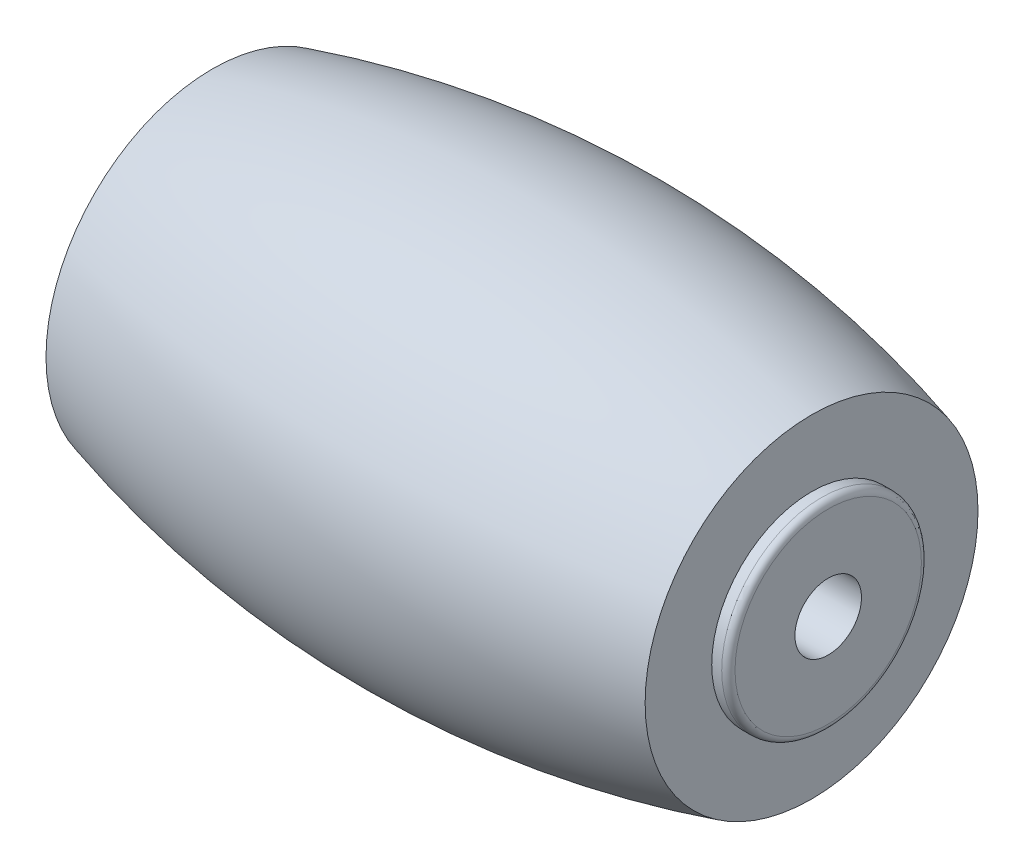
ISO-10303-21;
HEADER;
FILE_DESCRIPTION(('STEP AP214'),'2;1');
FILE_NAME('part.step','',(''),(''),'','','');
FILE_SCHEMA(('AUTOMOTIVE_DESIGN { 1 0 10303 214 1 1 1 1 }'));
ENDSEC;
DATA;
#1=APPLICATION_CONTEXT('core data for automotive mechanical design processes');
#2=APPLICATION_PROTOCOL_DEFINITION('international standard','automotive_design',2000,#1);
#3=PRODUCT_CONTEXT('',#1,'mechanical');
#4=PRODUCT('Part','Part','',(#3));
#5=PRODUCT_RELATED_PRODUCT_CATEGORY('part','',(#4));
#6=PRODUCT_DEFINITION_FORMATION('','',#4);
#7=PRODUCT_DEFINITION_CONTEXT('part definition',#1,'design');
#8=PRODUCT_DEFINITION('design','',#6,#7);
#9=PRODUCT_DEFINITION_SHAPE('','',#8);
#10=(LENGTH_UNIT() NAMED_UNIT(*) SI_UNIT(.MILLI.,.METRE.));
#11=(NAMED_UNIT(*) PLANE_ANGLE_UNIT() SI_UNIT($,.RADIAN.));
#12=(NAMED_UNIT(*) SI_UNIT($,.STERADIAN.) SOLID_ANGLE_UNIT());
#13=UNCERTAINTY_MEASURE_WITH_UNIT(LENGTH_MEASURE(1.E-05),#10,'distance_accuracy_value','');
#14=(GEOMETRIC_REPRESENTATION_CONTEXT(3) GLOBAL_UNCERTAINTY_ASSIGNED_CONTEXT((#13)) GLOBAL_UNIT_ASSIGNED_CONTEXT((#10,
#11,#12)) REPRESENTATION_CONTEXT('',''));
#15=CARTESIAN_POINT('',(0.,0.,0.));
#16=DIRECTION('',(0.,0.,1.));
#17=DIRECTION('',(1.,0.,0.));
#18=AXIS2_PLACEMENT_3D('',#15,#16,#17);
#19=CARTESIAN_POINT('',(8.99999999999995,0.,0.));
#20=DIRECTION('',(1.,0.,0.));
#21=DIRECTION('',(0.,0.,-0.999999999999998));
#22=AXIS2_PLACEMENT_3D('',#19,#20,#21);
#23=PLANE('',#22);
#24=CARTESIAN_POINT('',(8.99999999999995,0.,0.));
#25=DIRECTION('',(1.,0.,0.));
#26=DIRECTION('',(0.,0.,-0.999999999999998));
#27=AXIS2_PLACEMENT_3D('',#24,#25,#26);
#28=CIRCLE('',#27,3.);
#29=CARTESIAN_POINT('',(8.99999999999995,0.,-3.));
#30=VERTEX_POINT('',#29);
#31=EDGE_CURVE('E67',#30,#30,#28,.T.);
#32=ORIENTED_EDGE('',*,*,#31,.F.);
#33=EDGE_LOOP('',(#32));
#34=FACE_BOUND('',#33,.T.);
#35=CARTESIAN_POINT('',(9.00000000000004,0.,0.));
#36=DIRECTION('',(1.,0.,0.));
#37=DIRECTION('',(0.,0.,-0.999999999999998));
#38=AXIS2_PLACEMENT_3D('',#35,#36,#37);
#39=CIRCLE('',#38,5.);
#40=CARTESIAN_POINT('',(9.00000000000004,0.,-5.00000000000006));
#41=VERTEX_POINT('',#40);
#42=EDGE_CURVE('E71',#41,#41,#39,.T.);
#43=ORIENTED_EDGE('',*,*,#42,.T.);
#44=EDGE_LOOP('',(#43));
#45=FACE_BOUND('',#44,.T.);
#46=ADVANCED_FACE('F47',(#34,#45),#23,.T.);
#47=CARTESIAN_POINT('',(-8.99999999999997,0.,0.));
#48=DIRECTION('',(-1.,0.,0.));
#49=DIRECTION('',(0.,0.,0.999999999999998));
#50=AXIS2_PLACEMENT_3D('',#47,#48,#49);
#51=PLANE('',#50);
#52=CARTESIAN_POINT('',(-8.99999999999997,0.,0.));
#53=DIRECTION('',(1.,0.,0.));
#54=DIRECTION('',(0.,0.,-0.999999999999998));
#55=AXIS2_PLACEMENT_3D('',#52,#53,#54);
#56=CIRCLE('',#55,3.);
#57=CARTESIAN_POINT('',(-8.99999999999997,0.,-2.99999999999994));
#58=VERTEX_POINT('',#57);
#59=EDGE_CURVE('E74',#58,#58,#56,.T.);
#60=ORIENTED_EDGE('',*,*,#59,.T.);
#61=EDGE_LOOP('',(#60));
#62=FACE_BOUND('',#61,.T.);
#63=CARTESIAN_POINT('',(-8.99999999999997,0.,0.));
#64=DIRECTION('',(1.,0.,0.));
#65=DIRECTION('',(0.,0.,-0.999999999999998));
#66=AXIS2_PLACEMENT_3D('',#63,#64,#65);
#67=CIRCLE('',#66,5.);
#68=CARTESIAN_POINT('',(-8.99999999999997,0.,-4.99999999999994));
#69=VERTEX_POINT('',#68);
#70=EDGE_CURVE('E68',#69,#69,#67,.T.);
#71=ORIENTED_EDGE('',*,*,#70,.F.);
#72=EDGE_LOOP('',(#71));
#73=FACE_BOUND('',#72,.T.);
#74=ADVANCED_FACE('F104',(#62,#73),#51,.T.);
#75=CARTESIAN_POINT('',(0.,0.,0.));
#76=DIRECTION('',(1.,0.,0.));
#77=DIRECTION('',(0.,0.,-0.999999999999998));
#78=AXIS2_PLACEMENT_3D('',#75,#76,#77);
#79=DEGENERATE_TOROIDAL_SURFACE('',#78,26.7836447571631,33.0333176361313,.F.);
#80=ORIENTED_EDGE('',*,*,#70,.T.);
#81=EDGE_LOOP('',(#80));
#82=FACE_BOUND('',#81,.T.);
#83=ORIENTED_EDGE('',*,*,#42,.F.);
#84=EDGE_LOOP('',(#83));
#85=FACE_BOUND('',#84,.T.);
#86=ADVANCED_FACE('F110',(#82,#85),#79,.F.);
#87=CARTESIAN_POINT('',(9.49999999999998,0.,0.));
#88=DIRECTION('',(-1.,0.,0.));
#89=DIRECTION('',(0.,0.,0.999999999999998));
#90=AXIS2_PLACEMENT_3D('',#87,#88,#89);
#91=CYLINDRICAL_SURFACE('',#90,3.);
#92=CARTESIAN_POINT('',(9.29999999999995,0.,0.));
#93=DIRECTION('',(1.,0.,0.));
#94=DIRECTION('',(0.,0.,-0.999999999999998));
#95=AXIS2_PLACEMENT_3D('',#92,#93,#94);
#96=CIRCLE('',#95,3.);
#97=CARTESIAN_POINT('',(9.29999999999995,0.,-2.99999999999994));
#98=VERTEX_POINT('',#97);
#99=EDGE_CURVE('E58',#98,#98,#96,.F.);
#100=ORIENTED_EDGE('',*,*,#99,.T.);
#101=EDGE_LOOP('',(#100));
#102=FACE_BOUND('',#101,.T.);
#103=ORIENTED_EDGE('',*,*,#31,.T.);
#104=EDGE_LOOP('',(#103));
#105=FACE_BOUND('',#104,.T.);
#106=ADVANCED_FACE('F127',(#102,#105),#91,.T.);
#107=CARTESIAN_POINT('',(9.49999999999998,0.,0.));
#108=DIRECTION('',(1.,0.,0.));
#109=DIRECTION('',(0.,0.,-0.999999999999998));
#110=AXIS2_PLACEMENT_3D('',#107,#108,#109);
#111=PLANE('',#110);
#112=CARTESIAN_POINT('',(9.49999999999998,0.,0.));
#113=DIRECTION('',(1.,0.,0.));
#114=DIRECTION('',(0.,0.,-0.999999999999998));
#115=AXIS2_PLACEMENT_3D('',#112,#113,#114);
#116=CIRCLE('',#115,2.8);
#117=CARTESIAN_POINT('',(9.49999999999998,0.,-2.79999999999998));
#118=VERTEX_POINT('',#117);
#119=EDGE_CURVE('E62',#118,#118,#116,.T.);
#120=ORIENTED_EDGE('',*,*,#119,.T.);
#121=EDGE_LOOP('',(#120));
#122=FACE_BOUND('',#121,.T.);
#123=CARTESIAN_POINT('',(9.49999999999998,0.,0.));
#124=DIRECTION('',(-1.,0.,0.));
#125=DIRECTION('',(0.,0.,0.999999999999998));
#126=AXIS2_PLACEMENT_3D('',#123,#124,#125);
#127=CIRCLE('',#126,1.);
#128=CARTESIAN_POINT('',(9.49999999999998,0.,1.00000000000001));
#129=VERTEX_POINT('',#128);
#130=EDGE_CURVE('E79',#129,#129,#127,.T.);
#131=ORIENTED_EDGE('',*,*,#130,.T.);
#132=EDGE_LOOP('',(#131));
#133=FACE_BOUND('',#132,.T.);
#134=ADVANCED_FACE('F86',(#122,#133),#111,.T.);
#135=CARTESIAN_POINT('',(-9.49999999999991,0.,0.));
#136=DIRECTION('',(1.,0.,0.));
#137=DIRECTION('',(0.,0.,-0.999999999999998));
#138=AXIS2_PLACEMENT_3D('',#135,#136,#137);
#139=CYLINDRICAL_SURFACE('',#138,3.);
#140=CARTESIAN_POINT('',(-9.30000000000002,0.,0.));
#141=DIRECTION('',(-1.,0.,0.));
#142=DIRECTION('',(0.,0.,0.999999999999998));
#143=AXIS2_PLACEMENT_3D('',#140,#141,#142);
#144=CIRCLE('',#143,3.);
#145=CARTESIAN_POINT('',(-9.30000000000002,0.,3.00000000000008));
#146=VERTEX_POINT('',#145);
#147=EDGE_CURVE('E54',#146,#146,#144,.F.);
#148=ORIENTED_EDGE('',*,*,#147,.T.);
#149=EDGE_LOOP('',(#148));
#150=FACE_BOUND('',#149,.T.);
#151=ORIENTED_EDGE('',*,*,#59,.F.);
#152=EDGE_LOOP('',(#151));
#153=FACE_BOUND('',#152,.T.);
#154=ADVANCED_FACE('F97',(#150,#153),#139,.T.);
#155=CARTESIAN_POINT('',(-9.49999999999991,0.,0.));
#156=DIRECTION('',(-1.,0.,0.));
#157=DIRECTION('',(0.,0.,-0.999999999999998));
#158=AXIS2_PLACEMENT_3D('',#155,#156,#157);
#159=PLANE('',#158);
#160=CARTESIAN_POINT('',(-9.49999999999991,0.,0.));
#161=DIRECTION('',(-1.,0.,0.));
#162=DIRECTION('',(0.,0.,0.999999999999998));
#163=AXIS2_PLACEMENT_3D('',#160,#161,#162);
#164=CIRCLE('',#163,2.8);
#165=CARTESIAN_POINT('',(-9.49999999999991,0.,2.8));
#166=VERTEX_POINT('',#165);
#167=EDGE_CURVE('E12',#166,#166,#164,.T.);
#168=ORIENTED_EDGE('',*,*,#167,.T.);
#169=EDGE_LOOP('',(#168));
#170=FACE_BOUND('',#169,.T.);
#171=CARTESIAN_POINT('',(-9.49999999999991,0.,0.));
#172=DIRECTION('',(-1.,0.,0.));
#173=DIRECTION('',(0.,0.,0.999999999999998));
#174=AXIS2_PLACEMENT_3D('',#171,#172,#173);
#175=CIRCLE('',#174,1.);
#176=CARTESIAN_POINT('',(-9.49999999999991,0.,0.999999999999998));
#177=VERTEX_POINT('',#176);
#178=EDGE_CURVE('E80',#177,#177,#175,.T.);
#179=ORIENTED_EDGE('',*,*,#178,.F.);
#180=EDGE_LOOP('',(#179));
#181=FACE_BOUND('',#180,.T.);
#182=ADVANCED_FACE('F92',(#170,#181),#159,.T.);
#183=CARTESIAN_POINT('',(9.49999999999998,0.,0.));
#184=DIRECTION('',(-1.,0.,0.));
#185=DIRECTION('',(0.,0.,0.999999999999998));
#186=AXIS2_PLACEMENT_3D('',#183,#184,#185);
#187=CYLINDRICAL_SURFACE('',#186,1.);
#188=ORIENTED_EDGE('',*,*,#130,.F.);
#189=EDGE_LOOP('',(#188));
#190=FACE_BOUND('',#189,.T.);
#191=ORIENTED_EDGE('',*,*,#178,.T.);
#192=EDGE_LOOP('',(#191));
#193=FACE_BOUND('',#192,.T.);
#194=ADVANCED_FACE('F88',(#190,#193),#187,.F.);
#195=CARTESIAN_POINT('',(9.29999999999995,0.,0.));
#196=DIRECTION('',(1.,0.,0.));
#197=DIRECTION('',(0.,0.,-0.999999999999998));
#198=AXIS2_PLACEMENT_3D('',#195,#196,#197);
#199=TOROIDAL_SURFACE('',#198,2.8,0.2);
#200=ORIENTED_EDGE('',*,*,#99,.F.);
#201=EDGE_LOOP('',(#200));
#202=FACE_BOUND('',#201,.T.);
#203=ORIENTED_EDGE('',*,*,#119,.F.);
#204=EDGE_LOOP('',(#203));
#205=FACE_BOUND('',#204,.T.);
#206=ADVANCED_FACE('F91',(#202,#205),#199,.T.);
#207=CARTESIAN_POINT('',(-9.30000000000002,0.,0.));
#208=DIRECTION('',(-1.,0.,0.));
#209=DIRECTION('',(0.,0.,0.999999999999998));
#210=AXIS2_PLACEMENT_3D('',#207,#208,#209);
#211=TOROIDAL_SURFACE('',#210,2.8,0.2);
#212=ORIENTED_EDGE('',*,*,#167,.F.);
#213=EDGE_LOOP('',(#212));
#214=FACE_BOUND('',#213,.T.);
#215=ORIENTED_EDGE('',*,*,#147,.F.);
#216=EDGE_LOOP('',(#215));
#217=FACE_BOUND('',#216,.T.);
#218=ADVANCED_FACE('F49',(#214,#217),#211,.T.);
#219=CLOSED_SHELL('',(#46,#74,#86,#106,#134,#154,#182,#194,#206,#218));
#220=MANIFOLD_SOLID_BREP('B2',#219);
#221=ADVANCED_BREP_SHAPE_REPRESENTATION('',(#18,#220),#14);
#222=SHAPE_DEFINITION_REPRESENTATION(#9,#221);
ENDSEC;
END-ISO-10303-21;
